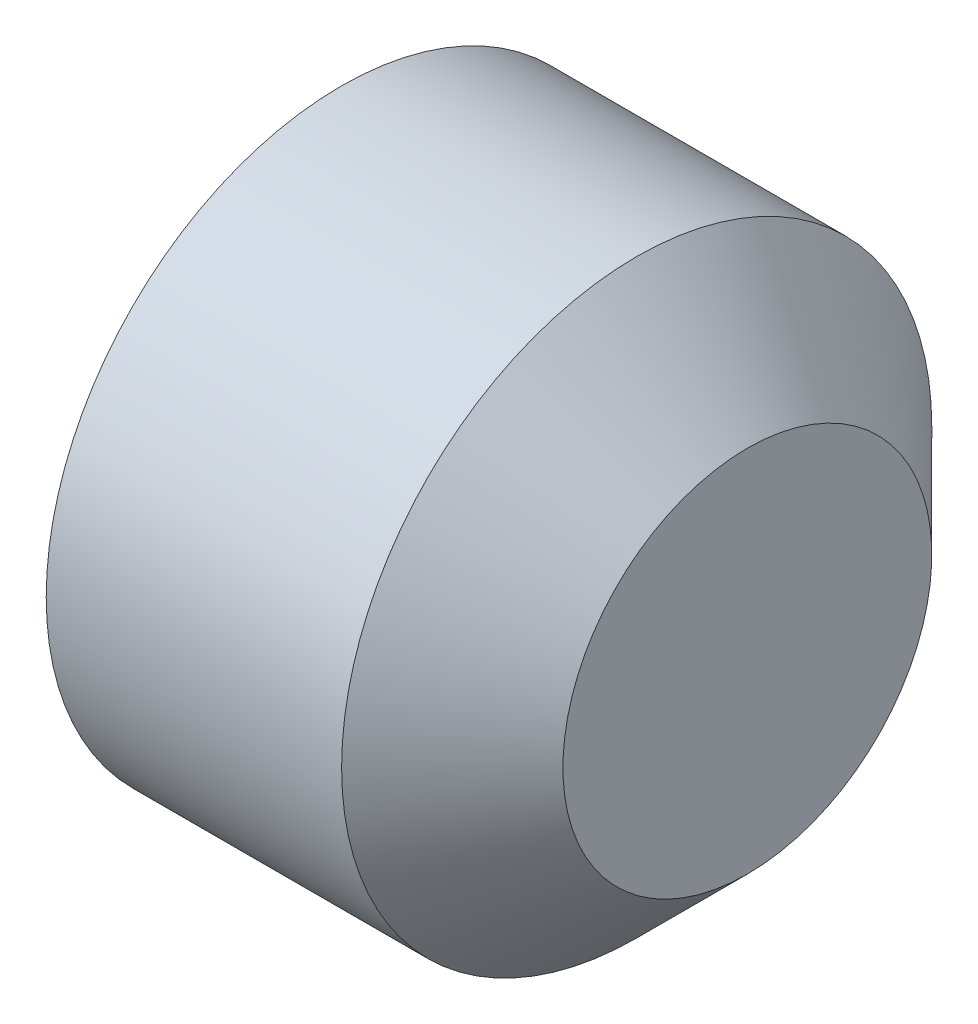
ISO-10303-21;
HEADER;
FILE_DESCRIPTION(('STEP AP214'),'2;1');
FILE_NAME('part.step','',(''),(''),'','','');
FILE_SCHEMA(('AUTOMOTIVE_DESIGN { 1 0 10303 214 1 1 1 1 }'));
ENDSEC;
DATA;
#1=APPLICATION_CONTEXT('core data for automotive mechanical design processes');
#2=APPLICATION_PROTOCOL_DEFINITION('international standard','automotive_design',2000,#1);
#3=PRODUCT_CONTEXT('',#1,'mechanical');
#4=PRODUCT('Part','Part','',(#3));
#5=PRODUCT_RELATED_PRODUCT_CATEGORY('part','',(#4));
#6=PRODUCT_DEFINITION_FORMATION('','',#4);
#7=PRODUCT_DEFINITION_CONTEXT('part definition',#1,'design');
#8=PRODUCT_DEFINITION('design','',#6,#7);
#9=PRODUCT_DEFINITION_SHAPE('','',#8);
#10=(LENGTH_UNIT() NAMED_UNIT(*) SI_UNIT(.MILLI.,.METRE.));
#11=(NAMED_UNIT(*) PLANE_ANGLE_UNIT() SI_UNIT($,.RADIAN.));
#12=(NAMED_UNIT(*) SI_UNIT($,.STERADIAN.) SOLID_ANGLE_UNIT());
#13=UNCERTAINTY_MEASURE_WITH_UNIT(LENGTH_MEASURE(1.E-05),#10,'distance_accuracy_value','');
#14=(GEOMETRIC_REPRESENTATION_CONTEXT(3) GLOBAL_UNCERTAINTY_ASSIGNED_CONTEXT((#13)) GLOBAL_UNIT_ASSIGNED_CONTEXT((#10,
#11,#12)) REPRESENTATION_CONTEXT('',''));
#15=CARTESIAN_POINT('',(0.,0.,0.));
#16=DIRECTION('',(0.,0.,1.));
#17=DIRECTION('',(1.,0.,0.));
#18=AXIS2_PLACEMENT_3D('',#15,#16,#17);
#19=CARTESIAN_POINT('',(0.66666666666667,0.,0.));
#20=DIRECTION('',(-1.,0.,0.));
#21=DIRECTION('',(0.,-1.,0.));
#22=AXIS2_PLACEMENT_3D('',#19,#20,#21);
#23=CONICAL_SURFACE('',#22,0.,1.04719755119661);
#24=CARTESIAN_POINT('',(0.,0.,0.));
#25=DIRECTION('',(-1.,0.,0.));
#26=DIRECTION('',(0.,-1.,0.));
#27=AXIS2_PLACEMENT_3D('',#24,#25,#26);
#28=CIRCLE('',#27,1.1547005383793);
#29=CARTESIAN_POINT('',(0.,0.,1.1547005383793));
#30=VERTEX_POINT('',#29);
#31=CARTESIAN_POINT('',(0.,1.00000000000008,0.577350269189584));
#32=VERTEX_POINT('',#31);
#33=EDGE_CURVE('E133',#30,#32,#28,.T.);
#34=ORIENTED_EDGE('',*,*,#33,.T.);
#35=CARTESIAN_POINT('',(-6.66766656399665E-05,1.0002,0.577234799135792));
#36=CARTESIAN_POINT('',(0.0145910263508786,0.956252680601721,0.602607795820553));
#37=CARTESIAN_POINT('',(0.0279222763791293,0.911926016050181,0.628199807531665));
#38=CARTESIAN_POINT('',(0.0511934923765663,0.822504925328881,0.679827098330841));
#39=CARTESIAN_POINT('',(0.061125223450238,0.777408908798272,0.70586329561417));
#40=CARTESIAN_POINT('',(0.0765873051179378,0.687775829477386,0.757612978088382));
#41=CARTESIAN_POINT('',(0.082220531901062,0.643252567766787,0.783318495222199));
#42=CARTESIAN_POINT('',(0.0889487113597592,0.55399626028499,0.83485064837369));
#43=CARTESIAN_POINT('',(0.0900492320783483,0.509263539518514,0.860677096749802));
#44=CARTESIAN_POINT('',(0.0877749477018723,0.425658889182662,0.908946264126714));
#45=CARTESIAN_POINT('',(0.0849585611365997,0.386774523211241,0.931396163287583));
#46=CARTESIAN_POINT('',(0.0760275497826569,0.30925915501482,0.976149681982124));
#47=CARTESIAN_POINT('',(0.0699098662457069,0.270628421438366,0.998453146411484));
#48=CARTESIAN_POINT('',(0.0546142742741818,0.192952883515859,1.0432991391405));
#49=CARTESIAN_POINT('',(0.0453714478310436,0.153917923728835,1.06583598368134));
#50=CARTESIAN_POINT('',(0.0243931542444719,0.0764306187239893,1.11057330008467));
#51=CARTESIAN_POINT('',(0.012662624866338,0.0379772787061415,1.13277434629522));
#52=CARTESIAN_POINT('',(-6.66766656664409E-05,-0.000200000000000106,1.15481600843314));
#53=B_SPLINE_CURVE_WITH_KNOTS('',3,(#35,#36,#37,#38,#39,#40,#41,#42,#43,#44,#45,#46,#47,#48,#49,
#50,#51,#52),.UNSPECIFIED.,.F.,.F.,(4,2,2,2,2,2,2,2,4),(0.,0.158523820030115,0.317428970089341,
0.472400167924632,0.627180939971646,0.762016584872715,0.896977373984242,1.03493410168669,
1.17261952416174),.UNSPECIFIED.);
#54=EDGE_CURVE('E11',#32,#30,#53,.T.);
#55=ORIENTED_EDGE('',*,*,#54,.T.);
#56=EDGE_LOOP('',(#34,#55));
#57=FACE_BOUND('',#56,.T.);
#58=ADVANCED_FACE('F31',(#57),#23,.F.);
#59=CARTESIAN_POINT('',(0.,-1.,0.57735026918963));
#60=VERTEX_POINT('',#59);
#61=EDGE_CURVE('E129',#60,#30,#28,.T.);
#62=ORIENTED_EDGE('',*,*,#61,.T.);
#63=CARTESIAN_POINT('',(-6.66766656665343E-05,0.000199999999999947,1.15481600843314));
#64=CARTESIAN_POINT('',(0.0145910263508541,-0.0437473193982807,1.12944301174838));
#65=CARTESIAN_POINT('',(0.027922276379107,-0.0880739839498216,1.10385100003726));
#66=CARTESIAN_POINT('',(0.0511934923765487,-0.177495074671124,1.05222370923809));
#67=CARTESIAN_POINT('',(0.0611252234502229,-0.222591091201734,1.02618751195476));
#68=CARTESIAN_POINT('',(0.0765873051179279,-0.312224170522623,0.974437829480542));
#69=CARTESIAN_POINT('',(0.0822205319010547,-0.356747432233225,0.948732312346724));
#70=CARTESIAN_POINT('',(0.0889487113597568,-0.446003739715024,0.897200159195231));
#71=CARTESIAN_POINT('',(0.0900492320783479,-0.490736460481502,0.871373710819119));
#72=CARTESIAN_POINT('',(0.0877749477018759,-0.574341110817354,0.823104543442207));
#73=CARTESIAN_POINT('',(0.0849585611366055,-0.613225476788773,0.800654644281338));
#74=CARTESIAN_POINT('',(0.0760275497826668,-0.690740844985192,0.755901125586799));
#75=CARTESIAN_POINT('',(0.0699098662457189,-0.729371578561644,0.73359766115744));
#76=CARTESIAN_POINT('',(0.054614274274198,-0.807047116484149,0.68875166842843));
#77=CARTESIAN_POINT('',(0.045371447831062,-0.84608207627117,0.666214823887585));
#78=CARTESIAN_POINT('',(0.0243931542444946,-0.923569381276013,0.621477507484257));
#79=CARTESIAN_POINT('',(0.0126626248663627,-0.96202272129386,0.599276461273711));
#80=CARTESIAN_POINT('',(-6.66766656397759E-05,-1.0002,0.577234799135792));
#81=B_SPLINE_CURVE_WITH_KNOTS('',3,(#63,#64,#65,#66,#67,#68,#69,#70,#71,#72,#73,#74,#75,#76,#77,
#78,#79,#80),.UNSPECIFIED.,.F.,.F.,(4,2,2,2,2,2,2,2,4),(0.,0.158523820030121,0.317428970089354,
0.47240016792465,0.627180939971671,0.762016584872733,0.896977373984255,1.03493410168669,
1.17261952416174),.UNSPECIFIED.);
#82=EDGE_CURVE('E44',#30,#60,#81,.T.);
#83=ORIENTED_EDGE('',*,*,#82,.T.);
#84=EDGE_LOOP('',(#62,#83));
#85=FACE_BOUND('',#84,.T.);
#86=ADVANCED_FACE('F199',(#85),#23,.F.);
#87=CARTESIAN_POINT('',(0.,-1.,-0.57735026918963));
#88=VERTEX_POINT('',#87);
#89=EDGE_CURVE('E128',#88,#60,#28,.T.);
#90=ORIENTED_EDGE('',*,*,#89,.T.);
#91=CARTESIAN_POINT('',(-0.371835288739451,-1.,-1.49514512143379));
#92=CARTESIAN_POINT('',(-0.351115020793417,-1.,-1.45196126115335));
#93=CARTESIAN_POINT('',(-0.330613672349449,-1.,-1.40867282404241));
#94=CARTESIAN_POINT('',(-0.290163433524583,-1.,-1.32182947914252));
#95=CARTESIAN_POINT('',(-0.270214642567272,-1.,-1.2782745250976));
#96=CARTESIAN_POINT('',(-0.211145154836465,-1.,-1.14662339890629));
#97=CARTESIAN_POINT('',(-0.173052526533021,-1.,-1.05805724149112));
#98=CARTESIAN_POINT('',(-0.100245820700553,-1.,-0.876833003172523));
#99=CARTESIAN_POINT('',(-0.0656458404538963,-1.,-0.784128452056518));
#100=CARTESIAN_POINT('',(-0.00407347381842811,-1.,-0.596331746532146));
#101=CARTESIAN_POINT('',(0.0229187151521698,-1.,-0.501246505541269));
#102=CARTESIAN_POINT('',(0.0542242299650066,-1.,-0.356699986452712));
#103=CARTESIAN_POINT('',(0.0631249014530373,-1.,-0.308244163171718));
#104=CARTESIAN_POINT('',(0.0772575682431124,-1.,-0.210788870695452));
#105=CARTESIAN_POINT('',(0.0824898114648446,-1.,-0.161789438465751));
#106=CARTESIAN_POINT('',(0.0888010190182573,-1.,-0.0641060489970755));
#107=CARTESIAN_POINT('',(0.0899289949889198,-1.,-0.0154253461269865));
#108=CARTESIAN_POINT('',(0.0880670216948876,-1.,0.0818553564032658));
#109=CARTESIAN_POINT('',(0.0850768174464161,-1.,0.130455350879693));
#110=CARTESIAN_POINT('',(0.0728816782707232,-1.,0.250369589613771));
#111=CARTESIAN_POINT('',(0.0613914390151371,-1.,0.321451919115022));
#112=CARTESIAN_POINT('',(0.0317596826023959,-1.,0.462229038490167));
#113=CARTESIAN_POINT('',(0.0136101490551007,-1.,0.531922048861734));
#114=CARTESIAN_POINT('',(-0.0278697226866181,-1.,0.671415729806811));
#115=CARTESIAN_POINT('',(-0.051307168306903,-1.,0.741183729418078));
#116=CARTESIAN_POINT('',(-0.101564488246382,-1.,0.8794383193963));
#117=CARTESIAN_POINT('',(-0.12838317523044,-1.,0.947925349932574));
#118=CARTESIAN_POINT('',(-0.200053915473368,-1.,1.12214515906646));
#119=CARTESIAN_POINT('',(-0.246572305198955,-1.,1.2271857404068));
#120=CARTESIAN_POINT('',(-0.342876922247949,-1.,1.4357596810456));
#121=CARTESIAN_POINT('',(-0.392663987822206,-1.,1.5392926453335));
#122=CARTESIAN_POINT('',(-0.494336444534604,-1.,1.74546702338824));
#123=CARTESIAN_POINT('',(-0.546224181866939,-1.,1.84810727554001));
#124=CARTESIAN_POINT('',(-0.651338368835187,-1.,2.05270058021729));
#125=CARTESIAN_POINT('',(-0.704564862672294,-1.,2.15465360991175));
#126=CARTESIAN_POINT('',(-0.806866916911162,-1.,2.34846553091286));
#127=CARTESIAN_POINT('',(-0.855859658963996,-1.,2.44036823161574));
#128=CARTESIAN_POINT('',(-0.954403132828168,-1.,2.62387799005304));
#129=CARTESIAN_POINT('',(-1.00395388528944,-1.,2.7154850366839));
#130=CARTESIAN_POINT('',(-1.10334710767978,-1.,2.89823865557597));
#131=CARTESIAN_POINT('',(-1.15318851504097,-1.,2.98938580641159));
#132=CARTESIAN_POINT('',(-1.25319572337608,-1.,3.17149583112626));
#133=CARTESIAN_POINT('',(-1.3033615072371,-1.,3.26245871439939));
#134=CARTESIAN_POINT('',(-1.35364621220491,-1.,3.3533553920818));
#135=B_SPLINE_CURVE_WITH_KNOTS('',3,(#91,#92,#93,#94,#95,#96,#97,#98,#99,#100,#101,#102,#103,
#104,#105,#106,#107,#108,#109,#110,#111,#112,#113,#114,#115,#116,#117,#118,#119,#120,#121,#122,
#123,#124,#125,#126,#127,#128,#129,#130,#131,#132,#133,#134),.UNSPECIFIED.,.F.,.F.,(4,2,2,2,2,2,
2,2,2,2,2,2,2,2,2,2,2,2,2,2,2,4),(0.,0.143690341820654,0.287406372566282,0.576560332877511,
0.873259488934062,1.1691790700001,1.31686338831961,1.46453772487646,1.61044269221663,
1.75635669390456,1.97192533331902,2.18775432802318,2.40842600301171,2.62902040304942,
2.97355048126465,3.3181692618629,3.66318417395138,4.00821049225249,4.32064609598604,
4.63309330006995,4.94474578248769,5.25638195528649),.UNSPECIFIED.);
#136=EDGE_CURVE('E175',#60,#88,#135,.F.);
#137=ORIENTED_EDGE('',*,*,#136,.T.);
#138=EDGE_LOOP('',(#90,#137));
#139=FACE_BOUND('',#138,.T.);
#140=ADVANCED_FACE('F205',(#139),#23,.F.);
#141=CARTESIAN_POINT('',(0.,0.,-1.1547005383793));
#142=VERTEX_POINT('',#141);
#143=EDGE_CURVE('E227',#142,#88,#28,.T.);
#144=ORIENTED_EDGE('',*,*,#143,.T.);
#145=CARTESIAN_POINT('',(-6.66766656396785E-05,-1.0002,-0.577234799135792));
#146=CARTESIAN_POINT('',(0.0145910263508786,-0.956252680601721,-0.602607795820553));
#147=CARTESIAN_POINT('',(0.0279222763791292,-0.911926016050181,-0.628199807531665));
#148=CARTESIAN_POINT('',(0.0511934923765662,-0.822504925328881,-0.679827098330841));
#149=CARTESIAN_POINT('',(0.061125223450238,-0.777408908798272,-0.70586329561417));
#150=CARTESIAN_POINT('',(0.076587305117938,-0.687775829477386,-0.757612978088382));
#151=CARTESIAN_POINT('',(0.0822205319010621,-0.643252567766786,-0.783318495222199));
#152=CARTESIAN_POINT('',(0.0889487113597592,-0.55399626028499,-0.83485064837369));
#153=CARTESIAN_POINT('',(0.0900492320783481,-0.509263539518514,-0.860677096749802));
#154=CARTESIAN_POINT('',(0.0877749477018722,-0.425658889182662,-0.908946264126714));
#155=CARTESIAN_POINT('',(0.0849585611365999,-0.386774523211241,-0.931396163287584));
#156=CARTESIAN_POINT('',(0.0760275497826571,-0.30925915501482,-0.976149681982124));
#157=CARTESIAN_POINT('',(0.0699098662457069,-0.270628421438366,-0.998453146411484));
#158=CARTESIAN_POINT('',(0.0546142742741816,-0.192952883515859,-1.0432991391405));
#159=CARTESIAN_POINT('',(0.0453714478310435,-0.153917923728835,-1.06583598368134));
#160=CARTESIAN_POINT('',(0.0243931542444719,-0.0764306187239892,-1.11057330008467));
#161=CARTESIAN_POINT('',(0.0126626248663381,-0.0379772787061413,-1.13277434629522));
#162=CARTESIAN_POINT('',(-6.66766656664812E-05,0.000200000000000098,-1.15481600843314));
#163=B_SPLINE_CURVE_WITH_KNOTS('',3,(#145,#146,#147,#148,#149,#150,#151,#152,#153,#154,#155,
#156,#157,#158,#159,#160,#161,#162),.UNSPECIFIED.,.F.,.F.,(4,2,2,2,2,2,2,2,4),(0.,
0.158523820030115,0.317428970089342,0.472400167924632,0.627180939971647,0.762016584872715,
0.896977373984243,1.03493410168669,1.17261952416174),.UNSPECIFIED.);
#164=EDGE_CURVE('E170',#88,#142,#163,.T.);
#165=ORIENTED_EDGE('',*,*,#164,.T.);
#166=EDGE_LOOP('',(#144,#165));
#167=FACE_BOUND('',#166,.T.);
#168=ADVANCED_FACE('F217',(#167),#23,.F.);
#169=CARTESIAN_POINT('',(0.,1.,-0.57735026918963));
#170=VERTEX_POINT('',#169);
#171=EDGE_CURVE('E225',#170,#142,#28,.T.);
#172=ORIENTED_EDGE('',*,*,#171,.T.);
#173=CARTESIAN_POINT('',(-6.66766656665343E-05,-0.000199999999999947,-1.15481600843314));
#174=CARTESIAN_POINT('',(0.0145910263508542,0.0437473193982806,-1.12944301174838));
#175=CARTESIAN_POINT('',(0.0279222763791071,0.0880739839498216,-1.10385100003726));
#176=CARTESIAN_POINT('',(0.0511934923765488,0.177495074671125,-1.05222370923809));
#177=CARTESIAN_POINT('',(0.061125223450223,0.222591091201735,-1.02618751195476));
#178=CARTESIAN_POINT('',(0.0765873051179279,0.312224170522623,-0.974437829480542));
#179=CARTESIAN_POINT('',(0.0822205319010546,0.356747432233225,-0.948732312346724));
#180=CARTESIAN_POINT('',(0.0889487113597566,0.446003739715024,-0.897200159195231));
#181=CARTESIAN_POINT('',(0.0900492320783478,0.490736460481502,-0.871373710819119));
#182=CARTESIAN_POINT('',(0.0877749477018758,0.574341110817354,-0.823104543442207));
#183=CARTESIAN_POINT('',(0.0849585611366055,0.613225476788773,-0.800654644281338));
#184=CARTESIAN_POINT('',(0.0760275497826669,0.690740844985192,-0.755901125586799));
#185=CARTESIAN_POINT('',(0.0699098662457189,0.729371578561644,-0.73359766115744));
#186=CARTESIAN_POINT('',(0.054614274274198,0.807047116484148,-0.68875166842843));
#187=CARTESIAN_POINT('',(0.0453714478310621,0.84608207627117,-0.666214823887585));
#188=CARTESIAN_POINT('',(0.0243931542444946,0.923569381276013,-0.621477507484257));
#189=CARTESIAN_POINT('',(0.0126626248663627,0.96202272129386,-0.599276461273711));
#190=CARTESIAN_POINT('',(-6.66766656400063E-05,1.0002,-0.577234799135792));
#191=B_SPLINE_CURVE_WITH_KNOTS('',3,(#173,#174,#175,#176,#177,#178,#179,#180,#181,#182,#183,
#184,#185,#186,#187,#188,#189,#190),.UNSPECIFIED.,.F.,.F.,(4,2,2,2,2,2,2,2,4),(0.,
0.158523820030121,0.317428970089354,0.472400167924651,0.627180939971671,0.762016584872733,
0.896977373984255,1.03493410168669,1.17261952416174),.UNSPECIFIED.);
#192=EDGE_CURVE('E111',#142,#170,#191,.T.);
#193=ORIENTED_EDGE('',*,*,#192,.T.);
#194=EDGE_LOOP('',(#172,#193));
#195=FACE_BOUND('',#194,.T.);
#196=ADVANCED_FACE('F209',(#195),#23,.F.);
#197=EDGE_CURVE('E221',#32,#170,#28,.T.);
#198=ORIENTED_EDGE('',*,*,#197,.T.);
#199=CARTESIAN_POINT('',(-0.371835288739452,1.,-1.49514512143379));
#200=CARTESIAN_POINT('',(-0.351115020793417,1.,-1.45196126115335));
#201=CARTESIAN_POINT('',(-0.33061367234945,1.,-1.40867282404241));
#202=CARTESIAN_POINT('',(-0.290163433524583,1.,-1.32182947914252));
#203=CARTESIAN_POINT('',(-0.270214642567272,1.,-1.2782745250976));
#204=CARTESIAN_POINT('',(-0.211145154836466,1.,-1.14662339890629));
#205=CARTESIAN_POINT('',(-0.173052526533021,1.,-1.05805724149112));
#206=CARTESIAN_POINT('',(-0.100245820700553,1.,-0.876833003172523));
#207=CARTESIAN_POINT('',(-0.0656458404538965,1.,-0.784128452056518));
#208=CARTESIAN_POINT('',(-0.00407347381842816,1.,-0.596331746532146));
#209=CARTESIAN_POINT('',(0.0229187151521698,1.,-0.501246505541268));
#210=CARTESIAN_POINT('',(0.0542242299650066,1.,-0.356699986452711));
#211=CARTESIAN_POINT('',(0.0631249014530372,1.,-0.308244163171718));
#212=CARTESIAN_POINT('',(0.0772575682431122,1.,-0.210788870695451));
#213=CARTESIAN_POINT('',(0.0824898114648444,1.,-0.161789438465751));
#214=CARTESIAN_POINT('',(0.0888010190182571,1.,-0.0641060489970751));
#215=CARTESIAN_POINT('',(0.0899289949889195,1.,-0.0154253461269861));
#216=CARTESIAN_POINT('',(0.0880670216948874,1.,0.0818553564032661));
#217=CARTESIAN_POINT('',(0.0850768174464159,1.,0.130455350879693));
#218=CARTESIAN_POINT('',(0.0728816782707231,1.,0.250369589613771));
#219=CARTESIAN_POINT('',(0.0613914390151369,1.,0.321451919115022));
#220=CARTESIAN_POINT('',(0.0317596826023956,1.,0.462229038490166));
#221=CARTESIAN_POINT('',(0.0136101490551005,1.,0.531922048861734));
#222=CARTESIAN_POINT('',(-0.0278697226866183,1.,0.671415729806811));
#223=CARTESIAN_POINT('',(-0.0513071683069032,1.,0.741183729418078));
#224=CARTESIAN_POINT('',(-0.101564488246382,1.,0.8794383193963));
#225=CARTESIAN_POINT('',(-0.12838317523044,1.,0.947925349932574));
#226=CARTESIAN_POINT('',(-0.200053915473368,1.,1.12214515906646));
#227=CARTESIAN_POINT('',(-0.246572305198956,1.,1.2271857404068));
#228=CARTESIAN_POINT('',(-0.34287692224795,1.,1.4357596810456));
#229=CARTESIAN_POINT('',(-0.392663987822206,1.,1.5392926453335));
#230=CARTESIAN_POINT('',(-0.494336444534604,1.,1.74546702338824));
#231=CARTESIAN_POINT('',(-0.546224181866939,1.,1.84810727554001));
#232=CARTESIAN_POINT('',(-0.651338368835186,1.,2.05270058021729));
#233=CARTESIAN_POINT('',(-0.704564862672293,1.,2.15465360991175));
#234=CARTESIAN_POINT('',(-0.806866916911162,1.,2.34846553091286));
#235=CARTESIAN_POINT('',(-0.855859658963996,1.,2.44036823161574));
#236=CARTESIAN_POINT('',(-0.954403132828169,1.,2.62387799005304));
#237=CARTESIAN_POINT('',(-1.00395388528944,1.,2.7154850366839));
#238=CARTESIAN_POINT('',(-1.10334710767978,1.,2.89823865557597));
#239=CARTESIAN_POINT('',(-1.15318851504097,1.,2.98938580641159));
#240=CARTESIAN_POINT('',(-1.25319572337608,1.,3.17149583112626));
#241=CARTESIAN_POINT('',(-1.3033615072371,1.,3.26245871439939));
#242=CARTESIAN_POINT('',(-1.35364621220492,1.,3.3533553920818));
#243=B_SPLINE_CURVE_WITH_KNOTS('',3,(#199,#200,#201,#202,#203,#204,#205,#206,#207,#208,#209,
#210,#211,#212,#213,#214,#215,#216,#217,#218,#219,#220,#221,#222,#223,#224,#225,#226,#227,#228,
#229,#230,#231,#232,#233,#234,#235,#236,#237,#238,#239,#240,#241,#242),.UNSPECIFIED.,.F.,.F.,(4,
2,2,2,2,2,2,2,2,2,2,2,2,2,2,2,2,2,2,2,2,4),(0.,0.143690341820654,0.287406372566282,
0.576560332877512,0.873259488934062,1.1691790700001,1.31686338831961,1.46453772487646,
1.61044269221663,1.75635669390456,1.97192533331902,2.18775432802318,2.40842600301171,
2.62902040304942,2.97355048126465,3.3181692618629,3.66318417395138,4.00821049225249,
4.32064609598604,4.63309330006995,4.94474578248769,5.25638195528649),.UNSPECIFIED.);
#244=EDGE_CURVE('E77',#170,#32,#243,.T.);
#245=ORIENTED_EDGE('',*,*,#244,.T.);
#246=EDGE_LOOP('',(#198,#245));
#247=FACE_BOUND('',#246,.T.);
#248=ADVANCED_FACE('F201',(#247),#23,.F.);
#249=CARTESIAN_POINT('',(3.,0.,0.));
#250=DIRECTION('',(1.,0.,0.));
#251=DIRECTION('',(0.,1.,0.));
#252=AXIS2_PLACEMENT_3D('',#249,#250,#251);
#253=PLANE('',#252);
#254=CARTESIAN_POINT('',(3.,0.,0.));
#255=DIRECTION('',(-1.,0.,0.));
#256=DIRECTION('',(0.,-1.,0.));
#257=AXIS2_PLACEMENT_3D('',#254,#255,#256);
#258=CIRCLE('',#257,1.25);
#259=CARTESIAN_POINT('',(3.,-1.25,0.));
#260=VERTEX_POINT('',#259);
#261=EDGE_CURVE('E142',#260,#260,#258,.T.);
#262=ORIENTED_EDGE('',*,*,#261,.F.);
#263=EDGE_LOOP('',(#262));
#264=FACE_BOUND('',#263,.T.);
#265=ADVANCED_FACE('F33',(#264),#253,.T.);
#266=CARTESIAN_POINT('',(2.25,0.,0.));
#267=DIRECTION('',(-1.,0.,0.));
#268=DIRECTION('',(0.,-1.,0.));
#269=AXIS2_PLACEMENT_3D('',#266,#267,#268);
#270=CONICAL_SURFACE('',#269,2.,0.785398163397448);
#271=ORIENTED_EDGE('',*,*,#261,.T.);
#272=EDGE_LOOP('',(#271));
#273=FACE_BOUND('',#272,.T.);
#274=CARTESIAN_POINT('',(2.25,0.,0.));
#275=DIRECTION('',(-1.,0.,0.));
#276=DIRECTION('',(0.,-1.,0.));
#277=AXIS2_PLACEMENT_3D('',#274,#275,#276);
#278=CIRCLE('',#277,2.);
#279=CARTESIAN_POINT('',(2.25,-2.,0.));
#280=VERTEX_POINT('',#279);
#281=EDGE_CURVE('E139',#280,#280,#278,.T.);
#282=ORIENTED_EDGE('',*,*,#281,.F.);
#283=EDGE_LOOP('',(#282));
#284=FACE_BOUND('',#283,.T.);
#285=ADVANCED_FACE('F215',(#273,#284),#270,.T.);
#286=CARTESIAN_POINT('',(0.66666666666667,0.,0.));
#287=DIRECTION('',(-1.,0.,0.));
#288=DIRECTION('',(0.,-1.,0.));
#289=AXIS2_PLACEMENT_3D('',#286,#287,#288);
#290=CYLINDRICAL_SURFACE('',#289,2.);
#291=ORIENTED_EDGE('',*,*,#281,.T.);
#292=EDGE_LOOP('',(#291));
#293=FACE_BOUND('',#292,.T.);
#294=CARTESIAN_POINT('',(0.24797194061694,0.,0.));
#295=DIRECTION('',(-1.,0.,0.));
#296=DIRECTION('',(0.,-1.,0.));
#297=AXIS2_PLACEMENT_3D('',#294,#295,#296);
#298=CIRCLE('',#297,2.);
#299=CARTESIAN_POINT('',(0.24797194061694,-2.,0.));
#300=VERTEX_POINT('',#299);
#301=EDGE_CURVE('E136',#300,#300,#298,.T.);
#302=ORIENTED_EDGE('',*,*,#301,.F.);
#303=EDGE_LOOP('',(#302));
#304=FACE_BOUND('',#303,.T.);
#305=ADVANCED_FACE('F324',(#293,#304),#290,.T.);
#306=CARTESIAN_POINT('',(0.,0.,0.));
#307=DIRECTION('',(1.,0.,0.));
#308=DIRECTION('',(0.,1.,0.));
#309=AXIS2_PLACEMENT_3D('',#306,#307,#308);
#310=CONICAL_SURFACE('',#309,1.5705,1.04719755119661);
#311=ORIENTED_EDGE('',*,*,#301,.T.);
#312=EDGE_LOOP('',(#311));
#313=FACE_BOUND('',#312,.T.);
#314=CARTESIAN_POINT('',(0.,0.,0.));
#315=DIRECTION('',(-1.,0.,0.));
#316=DIRECTION('',(0.,-1.,0.));
#317=AXIS2_PLACEMENT_3D('',#314,#315,#316);
#318=CIRCLE('',#317,1.5705);
#319=CARTESIAN_POINT('',(0.,-1.5705,0.));
#320=VERTEX_POINT('',#319);
#321=EDGE_CURVE('E132',#320,#320,#318,.T.);
#322=ORIENTED_EDGE('',*,*,#321,.F.);
#323=EDGE_LOOP('',(#322));
#324=FACE_BOUND('',#323,.T.);
#325=ADVANCED_FACE('F196',(#313,#324),#310,.T.);
#326=CARTESIAN_POINT('',(0.,-1.5705,0.));
#327=DIRECTION('',(-1.,0.,0.));
#328=DIRECTION('',(0.,-1.,0.));
#329=AXIS2_PLACEMENT_3D('',#326,#327,#328);
#330=PLANE('',#329);
#331=ORIENTED_EDGE('',*,*,#321,.T.);
#332=EDGE_LOOP('',(#331));
#333=FACE_BOUND('',#332,.T.);
#334=ORIENTED_EDGE('',*,*,#61,.F.);
#335=ORIENTED_EDGE('',*,*,#89,.F.);
#336=ORIENTED_EDGE('',*,*,#143,.F.);
#337=ORIENTED_EDGE('',*,*,#171,.F.);
#338=ORIENTED_EDGE('',*,*,#197,.F.);
#339=ORIENTED_EDGE('',*,*,#33,.F.);
#340=EDGE_LOOP('',(#334,#335,#336,#337,#338,#339));
#341=FACE_BOUND('',#340,.T.);
#342=ADVANCED_FACE('F191',(#333,#341),#330,.T.);
#343=CARTESIAN_POINT('',(1.5,1.,0.57735026918963));
#344=DIRECTION('',(0.,-0.500000000000029,-0.866025403784422));
#345=DIRECTION('',(0.,0.866025403784422,-0.500000000000029));
#346=AXIS2_PLACEMENT_3D('',#343,#344,#345);
#347=PLANE('',#346);
#348=DIRECTION('',(-1.,0.,0.));
#349=VECTOR('',#348,1.);
#350=CARTESIAN_POINT('',(1.5,1.,0.57735026918963));
#351=LINE('',#350,#349);
#352=CARTESIAN_POINT('',(1.5,1.,0.57735026918963));
#353=VERTEX_POINT('',#352);
#354=EDGE_CURVE('E51',#353,#32,#351,.T.);
#355=ORIENTED_EDGE('',*,*,#354,.F.);
#356=DIRECTION('',(0.,-0.866025403784422,0.500000000000029));
#357=VECTOR('',#356,1.);
#358=CARTESIAN_POINT('',(1.5,1.,0.57735026918963));
#359=LINE('',#358,#357);
#360=CARTESIAN_POINT('',(1.5,0.,1.1547005383793));
#361=VERTEX_POINT('',#360);
#362=EDGE_CURVE('E237',#353,#361,#359,.T.);
#363=ORIENTED_EDGE('',*,*,#362,.T.);
#364=DIRECTION('',(-1.,0.,0.));
#365=VECTOR('',#364,1.);
#366=CARTESIAN_POINT('',(1.5,0.,1.1547005383793));
#367=LINE('',#366,#365);
#368=EDGE_CURVE('E125',#361,#30,#367,.T.);
#369=ORIENTED_EDGE('',*,*,#368,.T.);
#370=ORIENTED_EDGE('',*,*,#54,.F.);
#371=EDGE_LOOP('',(#355,#363,#369,#370));
#372=FACE_BOUND('',#371,.T.);
#373=ADVANCED_FACE('F187',(#372),#347,.T.);
#374=CARTESIAN_POINT('',(1.5,0.,1.1547005383793));
#375=DIRECTION('',(0.,0.500000000000029,-0.866025403784422));
#376=DIRECTION('',(0.,0.866025403784422,0.500000000000029));
#377=AXIS2_PLACEMENT_3D('',#374,#375,#376);
#378=PLANE('',#377);
#379=ORIENTED_EDGE('',*,*,#368,.F.);
#380=DIRECTION('',(0.,-0.866025403784422,-0.500000000000029));
#381=VECTOR('',#380,1.);
#382=CARTESIAN_POINT('',(1.5,0.,1.1547005383793));
#383=LINE('',#382,#381);
#384=CARTESIAN_POINT('',(1.5,-1.,0.57735026918963));
#385=VERTEX_POINT('',#384);
#386=EDGE_CURVE('E86',#361,#385,#383,.T.);
#387=ORIENTED_EDGE('',*,*,#386,.T.);
#388=DIRECTION('',(-1.,0.,0.));
#389=VECTOR('',#388,1.);
#390=CARTESIAN_POINT('',(1.5,-1.,0.57735026918963));
#391=LINE('',#390,#389);
#392=EDGE_CURVE('E122',#385,#60,#391,.T.);
#393=ORIENTED_EDGE('',*,*,#392,.T.);
#394=ORIENTED_EDGE('',*,*,#82,.F.);
#395=EDGE_LOOP('',(#379,#387,#393,#394));
#396=FACE_BOUND('',#395,.T.);
#397=ADVANCED_FACE('F184',(#396),#378,.T.);
#398=CARTESIAN_POINT('',(1.5,-1.,0.57735026918963));
#399=DIRECTION('',(0.,1.,0.));
#400=DIRECTION('',(0.,0.,1.));
#401=AXIS2_PLACEMENT_3D('',#398,#399,#400);
#402=PLANE('',#401);
#403=ORIENTED_EDGE('',*,*,#392,.F.);
#404=DIRECTION('',(0.,0.,-1.));
#405=VECTOR('',#404,1.);
#406=CARTESIAN_POINT('',(1.5,-1.,0.57735026918963));
#407=LINE('',#406,#405);
#408=CARTESIAN_POINT('',(1.5,-1.,-0.57735026918963));
#409=VERTEX_POINT('',#408);
#410=EDGE_CURVE('E106',#385,#409,#407,.T.);
#411=ORIENTED_EDGE('',*,*,#410,.T.);
#412=DIRECTION('',(-1.,0.,0.));
#413=VECTOR('',#412,1.);
#414=CARTESIAN_POINT('',(1.5,-1.,-0.57735026918963));
#415=LINE('',#414,#413);
#416=EDGE_CURVE('E103',#409,#88,#415,.T.);
#417=ORIENTED_EDGE('',*,*,#416,.T.);
#418=ORIENTED_EDGE('',*,*,#136,.F.);
#419=EDGE_LOOP('',(#403,#411,#417,#418));
#420=FACE_BOUND('',#419,.T.);
#421=ADVANCED_FACE('F167',(#420),#402,.T.);
#422=CARTESIAN_POINT('',(1.5,-1.,-0.57735026918963));
#423=DIRECTION('',(0.,0.500000000000029,0.866025403784422));
#424=DIRECTION('',(0.,-0.866025403784422,0.500000000000029));
#425=AXIS2_PLACEMENT_3D('',#422,#423,#424);
#426=PLANE('',#425);
#427=ORIENTED_EDGE('',*,*,#416,.F.);
#428=DIRECTION('',(0.,0.866025403784422,-0.500000000000029));
#429=VECTOR('',#428,1.);
#430=CARTESIAN_POINT('',(1.5,-1.,-0.57735026918963));
#431=LINE('',#430,#429);
#432=CARTESIAN_POINT('',(1.5,0.,-1.1547005383793));
#433=VERTEX_POINT('',#432);
#434=EDGE_CURVE('E97',#409,#433,#431,.T.);
#435=ORIENTED_EDGE('',*,*,#434,.T.);
#436=DIRECTION('',(-1.,0.,0.));
#437=VECTOR('',#436,1.);
#438=CARTESIAN_POINT('',(1.5,0.,-1.1547005383793));
#439=LINE('',#438,#437);
#440=EDGE_CURVE('E100',#433,#142,#439,.T.);
#441=ORIENTED_EDGE('',*,*,#440,.T.);
#442=ORIENTED_EDGE('',*,*,#164,.F.);
#443=EDGE_LOOP('',(#427,#435,#441,#442));
#444=FACE_BOUND('',#443,.T.);
#445=ADVANCED_FACE('F99',(#444),#426,.T.);
#446=CARTESIAN_POINT('',(1.5,0.,-1.1547005383793));
#447=DIRECTION('',(0.,-0.500000000000029,0.866025403784422));
#448=DIRECTION('',(0.,-0.866025403784422,-0.500000000000029));
#449=AXIS2_PLACEMENT_3D('',#446,#447,#448);
#450=PLANE('',#449);
#451=ORIENTED_EDGE('',*,*,#440,.F.);
#452=DIRECTION('',(0.,0.866025403784422,0.500000000000029));
#453=VECTOR('',#452,1.);
#454=CARTESIAN_POINT('',(1.5,0.,-1.1547005383793));
#455=LINE('',#454,#453);
#456=CARTESIAN_POINT('',(1.5,1.,-0.57735026918963));
#457=VERTEX_POINT('',#456);
#458=EDGE_CURVE('E105',#433,#457,#455,.T.);
#459=ORIENTED_EDGE('',*,*,#458,.T.);
#460=DIRECTION('',(-1.,0.,0.));
#461=VECTOR('',#460,1.);
#462=CARTESIAN_POINT('',(1.5,1.,-0.57735026918963));
#463=LINE('',#462,#461);
#464=EDGE_CURVE('E112',#457,#170,#463,.T.);
#465=ORIENTED_EDGE('',*,*,#464,.T.);
#466=ORIENTED_EDGE('',*,*,#192,.F.);
#467=EDGE_LOOP('',(#451,#459,#465,#466));
#468=FACE_BOUND('',#467,.T.);
#469=ADVANCED_FACE('F109',(#468),#450,.T.);
#470=CARTESIAN_POINT('',(1.5,1.,-0.57735026918963));
#471=DIRECTION('',(0.,-1.,0.));
#472=DIRECTION('',(0.,0.,-1.));
#473=AXIS2_PLACEMENT_3D('',#470,#471,#472);
#474=PLANE('',#473);
#475=ORIENTED_EDGE('',*,*,#464,.F.);
#476=DIRECTION('',(0.,0.,1.));
#477=VECTOR('',#476,1.);
#478=CARTESIAN_POINT('',(1.5,1.,-0.57735026918963));
#479=LINE('',#478,#477);
#480=EDGE_CURVE('E57',#457,#353,#479,.T.);
#481=ORIENTED_EDGE('',*,*,#480,.T.);
#482=ORIENTED_EDGE('',*,*,#354,.T.);
#483=ORIENTED_EDGE('',*,*,#244,.F.);
#484=EDGE_LOOP('',(#475,#481,#482,#483));
#485=FACE_BOUND('',#484,.T.);
#486=ADVANCED_FACE('F157',(#485),#474,.T.);
#487=CARTESIAN_POINT('',(1.5,0.,1.1547005383793));
#488=DIRECTION('',(1.,0.,0.));
#489=DIRECTION('',(0.,0.,-1.));
#490=AXIS2_PLACEMENT_3D('',#487,#488,#489);
#491=PLANE('',#490);
#492=ORIENTED_EDGE('',*,*,#362,.F.);
#493=ORIENTED_EDGE('',*,*,#480,.F.);
#494=ORIENTED_EDGE('',*,*,#458,.F.);
#495=ORIENTED_EDGE('',*,*,#434,.F.);
#496=ORIENTED_EDGE('',*,*,#410,.F.);
#497=ORIENTED_EDGE('',*,*,#386,.F.);
#498=EDGE_LOOP('',(#492,#493,#494,#495,#496,#497));
#499=FACE_BOUND('',#498,.T.);
#500=ADVANCED_FACE('F114',(#499),#491,.F.);
#501=CLOSED_SHELL('',(#58,#86,#140,#168,#196,#248,#265,#285,#305,#325,#342,#373,#397,#421,#445,
#469,#486,#500));
#502=MANIFOLD_SOLID_BREP('B2',#501);
#503=ADVANCED_BREP_SHAPE_REPRESENTATION('',(#18,#502),#14);
#504=SHAPE_DEFINITION_REPRESENTATION(#9,#503);
ENDSEC;
END-ISO-10303-21;
